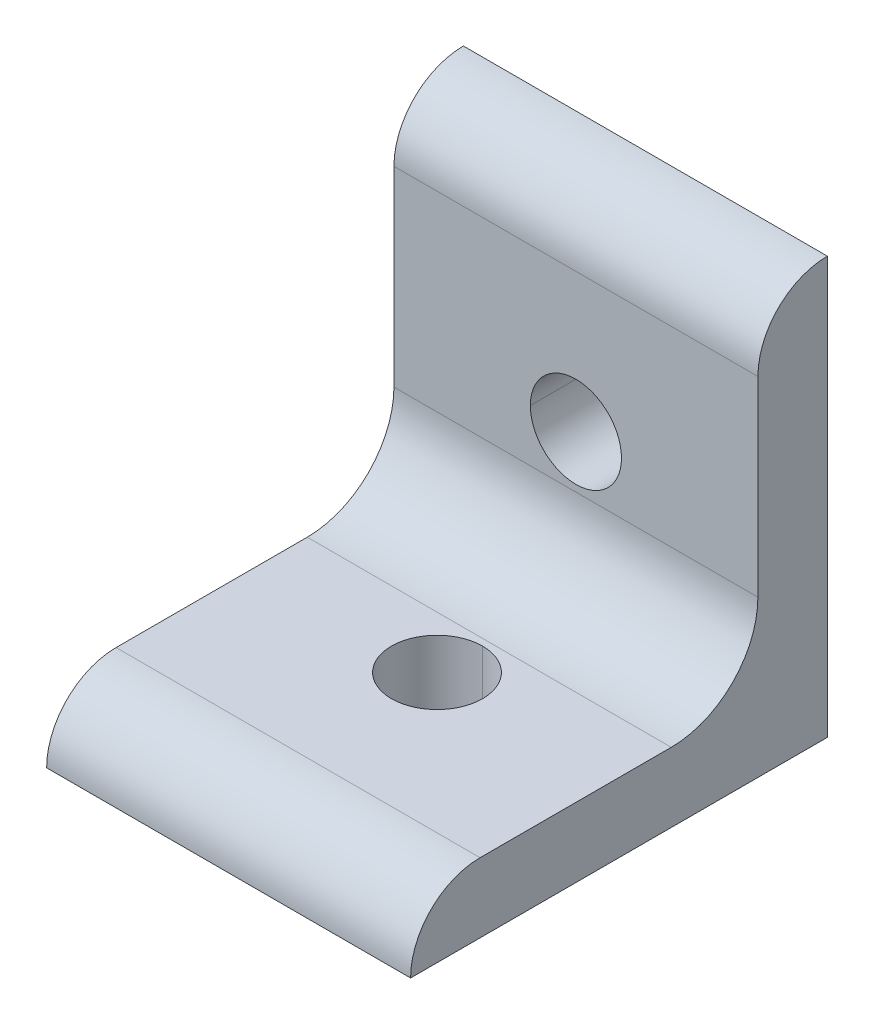
ISO-10303-21;
HEADER;
FILE_DESCRIPTION(('STEP AP214'),'2;1');
FILE_NAME('part.step','',(''),(''),'','','');
FILE_SCHEMA(('AUTOMOTIVE_DESIGN { 1 0 10303 214 1 1 1 1 }'));
ENDSEC;
DATA;
#1=APPLICATION_CONTEXT('core data for automotive mechanical design processes');
#2=APPLICATION_PROTOCOL_DEFINITION('international standard','automotive_design',2000,#1);
#3=PRODUCT_CONTEXT('',#1,'mechanical');
#4=PRODUCT('Part','Part','',(#3));
#5=PRODUCT_RELATED_PRODUCT_CATEGORY('part','',(#4));
#6=PRODUCT_DEFINITION_FORMATION('','',#4);
#7=PRODUCT_DEFINITION_CONTEXT('part definition',#1,'design');
#8=PRODUCT_DEFINITION('design','',#6,#7);
#9=PRODUCT_DEFINITION_SHAPE('','',#8);
#10=(LENGTH_UNIT() NAMED_UNIT(*) SI_UNIT(.MILLI.,.METRE.));
#11=(NAMED_UNIT(*) PLANE_ANGLE_UNIT() SI_UNIT($,.RADIAN.));
#12=(NAMED_UNIT(*) SI_UNIT($,.STERADIAN.) SOLID_ANGLE_UNIT());
#13=UNCERTAINTY_MEASURE_WITH_UNIT(LENGTH_MEASURE(1.E-05),#10,'distance_accuracy_value','');
#14=(GEOMETRIC_REPRESENTATION_CONTEXT(3) GLOBAL_UNCERTAINTY_ASSIGNED_CONTEXT((#13)) GLOBAL_UNIT_ASSIGNED_CONTEXT((#10,
#11,#12)) REPRESENTATION_CONTEXT('',''));
#15=CARTESIAN_POINT('',(0.,0.,0.));
#16=DIRECTION('',(0.,0.,1.));
#17=DIRECTION('',(1.,0.,0.));
#18=AXIS2_PLACEMENT_3D('',#15,#16,#17);
#19=CARTESIAN_POINT('',(7.20261909646393,12.5858555645789,28.1777497000586));
#20=DIRECTION('',(-1.,0.,0.));
#21=DIRECTION('',(0.,-0.707106781186548,-0.707106781186547));
#22=AXIS2_PLACEMENT_3D('',#19,#20,#21);
#23=CYLINDRICAL_SURFACE('',#22,6.35000000000146);
#24=CARTESIAN_POINT('',(-26.0713809035361,12.5858555645789,28.1777497000586));
#25=DIRECTION('',(1.,0.,0.));
#26=DIRECTION('',(0.,0.,-1.));
#27=AXIS2_PLACEMENT_3D('',#24,#25,#26);
#28=CIRCLE('',#27,6.35000000000146);
#29=CARTESIAN_POINT('',(-26.0713809035361,18.9358555645804,28.17774970006));
#30=VERTEX_POINT('',#29);
#31=CARTESIAN_POINT('',(-26.0713809035361,12.5858555645804,34.52774970006));
#32=VERTEX_POINT('',#31);
#33=EDGE_CURVE('E11',#30,#32,#28,.T.);
#34=ORIENTED_EDGE('',*,*,#33,.T.);
#35=DIRECTION('',(-1.,0.,0.));
#36=VECTOR('',#35,1.);
#37=CARTESIAN_POINT('',(7.20261909646393,12.5858555645804,34.52774970006));
#38=LINE('',#37,#36);
#39=CARTESIAN_POINT('',(7.20261909646393,12.5858555645804,34.52774970006));
#40=VERTEX_POINT('',#39);
#41=EDGE_CURVE('E56',#40,#32,#38,.T.);
#42=ORIENTED_EDGE('',*,*,#41,.F.);
#43=CARTESIAN_POINT('',(7.20261909646393,12.5858555645789,28.1777497000586));
#44=DIRECTION('',(1.,0.,0.));
#45=DIRECTION('',(0.,0.,-1.));
#46=AXIS2_PLACEMENT_3D('',#43,#44,#45);
#47=CIRCLE('',#46,6.35000000000146);
#48=CARTESIAN_POINT('',(7.20261909646393,18.9358555645804,28.17774970006));
#49=VERTEX_POINT('',#48);
#50=EDGE_CURVE('E317',#49,#40,#47,.T.);
#51=ORIENTED_EDGE('',*,*,#50,.F.);
#52=DIRECTION('',(-1.,0.,0.));
#53=VECTOR('',#52,1.);
#54=CARTESIAN_POINT('',(7.20261909646393,18.9358555645804,28.17774970006));
#55=LINE('',#54,#53);
#56=EDGE_CURVE('E312',#49,#30,#55,.T.);
#57=ORIENTED_EDGE('',*,*,#56,.T.);
#58=EDGE_LOOP('',(#34,#42,#51,#57));
#59=FACE_BOUND('',#58,.T.);
#60=ADVANCED_FACE('F47',(#59),#23,.T.);
#61=CARTESIAN_POINT('',(7.20261909646393,18.9358555645804,10.70254970006));
#62=DIRECTION('',(0.,-1.,0.));
#63=DIRECTION('',(0.,0.,-1.));
#64=AXIS2_PLACEMENT_3D('',#61,#62,#63);
#65=PLANE('',#64);
#66=CARTESIAN_POINT('',(-9.43438090353607,18.9358555645804,15.47774970006));
#67=DIRECTION('',(0.,1.,0.));
#68=DIRECTION('',(1.,0.,0.));
#69=AXIS2_PLACEMENT_3D('',#66,#67,#68);
#70=CIRCLE('',#69,4.1656);
#71=CARTESIAN_POINT('',(-9.43438090353607,18.9358555645804,11.31214970006));
#72=VERTEX_POINT('',#71);
#73=CARTESIAN_POINT('',(-9.43438090353607,18.9358555645804,19.64334970006));
#74=VERTEX_POINT('',#73);
#75=EDGE_CURVE('E307',#72,#74,#70,.T.);
#76=ORIENTED_EDGE('',*,*,#75,.F.);
#77=CARTESIAN_POINT('',(-9.43438090353607,18.9358555645804,15.47774970006));
#78=DIRECTION('',(0.,1.,0.));
#79=DIRECTION('',(0.,0.,1.));
#80=AXIS2_PLACEMENT_3D('',#77,#78,#79);
#81=CIRCLE('',#80,4.1656);
#82=EDGE_CURVE('E170',#74,#72,#81,.T.);
#83=ORIENTED_EDGE('',*,*,#82,.F.);
#84=EDGE_LOOP('',(#76,#83));
#85=FACE_BOUND('',#84,.T.);
#86=DIRECTION('',(0.,0.,1.));
#87=VECTOR('',#86,1.);
#88=CARTESIAN_POINT('',(-26.0713809035361,18.9358555645804,10.70254970006));
#89=LINE('',#88,#87);
#90=CARTESIAN_POINT('',(-26.0713809035361,18.9358555645804,10.70254970006));
#91=VERTEX_POINT('',#90);
#92=EDGE_CURVE('E297',#91,#30,#89,.T.);
#93=ORIENTED_EDGE('',*,*,#92,.T.);
#94=ORIENTED_EDGE('',*,*,#56,.F.);
#95=DIRECTION('',(0.,0.,1.));
#96=VECTOR('',#95,1.);
#97=CARTESIAN_POINT('',(7.20261909646393,18.9358555645804,10.70254970006));
#98=LINE('',#97,#96);
#99=CARTESIAN_POINT('',(7.20261909646393,18.9358555645804,10.70254970006));
#100=VERTEX_POINT('',#99);
#101=EDGE_CURVE('E291',#100,#49,#98,.T.);
#102=ORIENTED_EDGE('',*,*,#101,.F.);
#103=DIRECTION('',(-1.,0.,0.));
#104=VECTOR('',#103,1.);
#105=CARTESIAN_POINT('',(7.20261909646393,18.9358555645804,10.70254970006));
#106=LINE('',#105,#104);
#107=EDGE_CURVE('E287',#100,#91,#106,.T.);
#108=ORIENTED_EDGE('',*,*,#107,.T.);
#109=EDGE_LOOP('',(#93,#94,#102,#108));
#110=FACE_BOUND('',#109,.T.);
#111=ADVANCED_FACE('F336',(#85,#110),#65,.F.);
#112=CARTESIAN_POINT('',(7.20261909646393,26.8606555645806,10.7025497000603));
#113=DIRECTION('',(-1.,0.,0.));
#114=DIRECTION('',(0.,0.707106781186537,0.707106781186558));
#115=AXIS2_PLACEMENT_3D('',#112,#113,#114);
#116=CYLINDRICAL_SURFACE('',#115,7.92480000000024);
#117=CARTESIAN_POINT('',(-26.0713809035361,26.8606555645806,10.7025497000603));
#118=DIRECTION('',(1.,0.,0.));
#119=DIRECTION('',(0.,0.,-1.));
#120=AXIS2_PLACEMENT_3D('',#117,#118,#119);
#121=CIRCLE('',#120,7.92480000000024);
#122=CARTESIAN_POINT('',(-26.0713809035361,26.8606555645804,2.77774970006001));
#123=VERTEX_POINT('',#122);
#124=EDGE_CURVE('E281',#91,#123,#121,.T.);
#125=ORIENTED_EDGE('',*,*,#124,.F.);
#126=ORIENTED_EDGE('',*,*,#107,.F.);
#127=CARTESIAN_POINT('',(7.20261909646393,26.8606555645806,10.7025497000603));
#128=DIRECTION('',(1.,0.,0.));
#129=DIRECTION('',(0.,0.,-1.));
#130=AXIS2_PLACEMENT_3D('',#127,#128,#129);
#131=CIRCLE('',#130,7.92480000000024);
#132=CARTESIAN_POINT('',(7.20261909646393,26.8606555645804,2.77774970006001));
#133=VERTEX_POINT('',#132);
#134=EDGE_CURVE('E276',#100,#133,#131,.T.);
#135=ORIENTED_EDGE('',*,*,#134,.T.);
#136=DIRECTION('',(-1.,0.,0.));
#137=VECTOR('',#136,1.);
#138=CARTESIAN_POINT('',(7.20261909646393,26.8606555645804,2.77774970006001));
#139=LINE('',#138,#137);
#140=EDGE_CURVE('E271',#133,#123,#139,.T.);
#141=ORIENTED_EDGE('',*,*,#140,.T.);
#142=EDGE_LOOP('',(#125,#126,#135,#141));
#143=FACE_BOUND('',#142,.T.);
#144=ADVANCED_FACE('F353',(#143),#116,.F.);
#145=CARTESIAN_POINT('',(7.20261909646393,44.3358555645804,2.77774970006001));
#146=DIRECTION('',(0.,0.,-1.));
#147=DIRECTION('',(-1.,0.,0.));
#148=AXIS2_PLACEMENT_3D('',#145,#146,#147);
#149=PLANE('',#148);
#150=CARTESIAN_POINT('',(-9.43438090353607,31.6358555645804,2.77774970006001));
#151=DIRECTION('',(0.,0.,1.));
#152=DIRECTION('',(1.,0.,0.));
#153=AXIS2_PLACEMENT_3D('',#150,#151,#152);
#154=CIRCLE('',#153,4.1656);
#155=CARTESIAN_POINT('',(-13.5999809035361,31.6358555645804,2.77774970006001));
#156=VERTEX_POINT('',#155);
#157=CARTESIAN_POINT('',(-5.26878090353607,31.6358555645804,2.77774970006001));
#158=VERTEX_POINT('',#157);
#159=EDGE_CURVE('E265',#156,#158,#154,.T.);
#160=ORIENTED_EDGE('',*,*,#159,.F.);
#161=CARTESIAN_POINT('',(-9.43438090353607,31.6358555645804,2.77774970006001));
#162=DIRECTION('',(0.,0.,1.));
#163=DIRECTION('',(1.,0.,0.));
#164=AXIS2_PLACEMENT_3D('',#161,#162,#163);
#165=CIRCLE('',#164,4.1656);
#166=EDGE_CURVE('E259',#158,#156,#165,.T.);
#167=ORIENTED_EDGE('',*,*,#166,.F.);
#168=EDGE_LOOP('',(#160,#167));
#169=FACE_BOUND('',#168,.T.);
#170=DIRECTION('',(0.,-1.,0.));
#171=VECTOR('',#170,1.);
#172=CARTESIAN_POINT('',(-26.0713809035361,44.3358555645804,2.77774970006001));
#173=LINE('',#172,#171);
#174=CARTESIAN_POINT('',(-26.0713809035361,44.3358555645804,2.77774970006001));
#175=VERTEX_POINT('',#174);
#176=EDGE_CURVE('E253',#175,#123,#173,.T.);
#177=ORIENTED_EDGE('',*,*,#176,.T.);
#178=ORIENTED_EDGE('',*,*,#140,.F.);
#179=DIRECTION('',(0.,-1.,0.));
#180=VECTOR('',#179,1.);
#181=CARTESIAN_POINT('',(7.20261909646393,44.3358555645804,2.77774970006001));
#182=LINE('',#181,#180);
#183=CARTESIAN_POINT('',(7.20261909646393,44.3358555645804,2.77774970006001));
#184=VERTEX_POINT('',#183);
#185=EDGE_CURVE('E247',#184,#133,#182,.T.);
#186=ORIENTED_EDGE('',*,*,#185,.F.);
#187=DIRECTION('',(-1.,0.,0.));
#188=VECTOR('',#187,1.);
#189=CARTESIAN_POINT('',(7.20261909646393,44.3358555645804,2.77774970006001));
#190=LINE('',#189,#188);
#191=EDGE_CURVE('E242',#184,#175,#190,.T.);
#192=ORIENTED_EDGE('',*,*,#191,.T.);
#193=EDGE_LOOP('',(#177,#178,#186,#192));
#194=FACE_BOUND('',#193,.T.);
#195=ADVANCED_FACE('F351',(#169,#194),#149,.F.);
#196=CARTESIAN_POINT('',(7.20261909646393,44.3358555645789,-3.57225029994145));
#197=DIRECTION('',(-1.,0.,0.));
#198=DIRECTION('',(0.,-0.707106781186547,-0.707106781186548));
#199=AXIS2_PLACEMENT_3D('',#196,#197,#198);
#200=CYLINDRICAL_SURFACE('',#199,6.35000000000146);
#201=CARTESIAN_POINT('',(-26.0713809035361,44.3358555645789,-3.57225029994145));
#202=DIRECTION('',(1.,0.,0.));
#203=DIRECTION('',(0.,0.,-1.));
#204=AXIS2_PLACEMENT_3D('',#201,#202,#203);
#205=CIRCLE('',#204,6.35000000000146);
#206=CARTESIAN_POINT('',(-26.0713809035361,50.6858555645804,-3.57225029993999));
#207=VERTEX_POINT('',#206);
#208=EDGE_CURVE('E236',#207,#175,#205,.T.);
#209=ORIENTED_EDGE('',*,*,#208,.T.);
#210=ORIENTED_EDGE('',*,*,#191,.F.);
#211=CARTESIAN_POINT('',(7.20261909646393,44.3358555645789,-3.57225029994145));
#212=DIRECTION('',(1.,0.,0.));
#213=DIRECTION('',(0.,0.,-1.));
#214=AXIS2_PLACEMENT_3D('',#211,#212,#213);
#215=CIRCLE('',#214,6.35000000000146);
#216=CARTESIAN_POINT('',(7.20261909646393,50.6858555645804,-3.57225029993999));
#217=VERTEX_POINT('',#216);
#218=EDGE_CURVE('E230',#217,#184,#215,.T.);
#219=ORIENTED_EDGE('',*,*,#218,.F.);
#220=DIRECTION('',(-1.,0.,0.));
#221=VECTOR('',#220,1.);
#222=CARTESIAN_POINT('',(7.20261909646393,50.6858555645804,-3.57225029993999));
#223=LINE('',#222,#221);
#224=EDGE_CURVE('E226',#217,#207,#223,.T.);
#225=ORIENTED_EDGE('',*,*,#224,.T.);
#226=EDGE_LOOP('',(#209,#210,#219,#225));
#227=FACE_BOUND('',#226,.T.);
#228=ADVANCED_FACE('F349',(#227),#200,.T.);
#229=CARTESIAN_POINT('',(7.20261909646393,12.5858555645804,-3.57225029993999));
#230=DIRECTION('',(0.,0.,1.));
#231=DIRECTION('',(1.,0.,0.));
#232=AXIS2_PLACEMENT_3D('',#229,#230,#231);
#233=PLANE('',#232);
#234=CARTESIAN_POINT('',(-9.43438090353607,31.6358555645804,-3.57225029993999));
#235=DIRECTION('',(0.,0.,1.));
#236=DIRECTION('',(1.,0.,0.));
#237=AXIS2_PLACEMENT_3D('',#234,#235,#236);
#238=CIRCLE('',#237,4.1656);
#239=CARTESIAN_POINT('',(-5.26878090353607,31.6358555645804,-3.57225029993999));
#240=VERTEX_POINT('',#239);
#241=CARTESIAN_POINT('',(-13.5999809035361,31.6358555645804,-3.57225029993999));
#242=VERTEX_POINT('',#241);
#243=EDGE_CURVE('E221',#240,#242,#238,.T.);
#244=ORIENTED_EDGE('',*,*,#243,.T.);
#245=CARTESIAN_POINT('',(-9.43438090353607,31.6358555645804,-3.57225029993999));
#246=DIRECTION('',(0.,0.,1.));
#247=DIRECTION('',(1.,0.,0.));
#248=AXIS2_PLACEMENT_3D('',#245,#246,#247);
#249=CIRCLE('',#248,4.1656);
#250=EDGE_CURVE('E216',#242,#240,#249,.T.);
#251=ORIENTED_EDGE('',*,*,#250,.T.);
#252=EDGE_LOOP('',(#244,#251));
#253=FACE_BOUND('',#252,.T.);
#254=DIRECTION('',(0.,1.,0.));
#255=VECTOR('',#254,1.);
#256=CARTESIAN_POINT('',(-26.0713809035361,12.5858555645804,-3.57225029993999));
#257=LINE('',#256,#255);
#258=CARTESIAN_POINT('',(-26.0713809035361,12.5858555645804,-3.57225029993999));
#259=VERTEX_POINT('',#258);
#260=EDGE_CURVE('E211',#259,#207,#257,.T.);
#261=ORIENTED_EDGE('',*,*,#260,.T.);
#262=ORIENTED_EDGE('',*,*,#224,.F.);
#263=DIRECTION('',(0.,1.,0.));
#264=VECTOR('',#263,1.);
#265=CARTESIAN_POINT('',(7.20261909646393,12.5858555645804,-3.57225029993999));
#266=LINE('',#265,#264);
#267=CARTESIAN_POINT('',(7.20261909646393,12.5858555645804,-3.57225029993999));
#268=VERTEX_POINT('',#267);
#269=EDGE_CURVE('E205',#268,#217,#266,.T.);
#270=ORIENTED_EDGE('',*,*,#269,.F.);
#271=DIRECTION('',(-1.,0.,0.));
#272=VECTOR('',#271,1.);
#273=CARTESIAN_POINT('',(7.20261909646393,12.5858555645804,-3.57225029993999));
#274=LINE('',#273,#272);
#275=EDGE_CURVE('E167',#268,#259,#274,.T.);
#276=ORIENTED_EDGE('',*,*,#275,.T.);
#277=EDGE_LOOP('',(#261,#262,#270,#276));
#278=FACE_BOUND('',#277,.T.);
#279=ADVANCED_FACE('F345',(#253,#278),#233,.F.);
#280=CARTESIAN_POINT('',(7.20261909646393,12.5858555645804,34.52774970006));
#281=DIRECTION('',(0.,1.,0.));
#282=DIRECTION('',(0.,0.,1.));
#283=AXIS2_PLACEMENT_3D('',#280,#281,#282);
#284=PLANE('',#283);
#285=CARTESIAN_POINT('',(-9.43438090353607,12.5858555645804,15.47774970006));
#286=DIRECTION('',(0.,1.,0.));
#287=DIRECTION('',(1.,0.,0.));
#288=AXIS2_PLACEMENT_3D('',#285,#286,#287);
#289=CIRCLE('',#288,4.1656);
#290=CARTESIAN_POINT('',(-9.43438090353607,12.5858555645804,11.31214970006));
#291=VERTEX_POINT('',#290);
#292=CARTESIAN_POINT('',(-9.43438090353607,12.5858555645804,19.64334970006));
#293=VERTEX_POINT('',#292);
#294=EDGE_CURVE('E151',#291,#293,#289,.T.);
#295=ORIENTED_EDGE('',*,*,#294,.T.);
#296=CARTESIAN_POINT('',(-9.43438090353607,12.5858555645804,15.47774970006));
#297=DIRECTION('',(0.,1.,0.));
#298=DIRECTION('',(0.,0.,1.));
#299=AXIS2_PLACEMENT_3D('',#296,#297,#298);
#300=CIRCLE('',#299,4.1656);
#301=EDGE_CURVE('E147',#293,#291,#300,.T.);
#302=ORIENTED_EDGE('',*,*,#301,.T.);
#303=EDGE_LOOP('',(#295,#302));
#304=FACE_BOUND('',#303,.T.);
#305=DIRECTION('',(0.,0.,-1.));
#306=VECTOR('',#305,1.);
#307=CARTESIAN_POINT('',(-26.0713809035361,12.5858555645804,34.52774970006));
#308=LINE('',#307,#306);
#309=EDGE_CURVE('E157',#32,#259,#308,.T.);
#310=ORIENTED_EDGE('',*,*,#309,.T.);
#311=ORIENTED_EDGE('',*,*,#275,.F.);
#312=DIRECTION('',(0.,0.,-1.));
#313=VECTOR('',#312,1.);
#314=CARTESIAN_POINT('',(7.20261909646393,12.5858555645804,34.52774970006));
#315=LINE('',#314,#313);
#316=EDGE_CURVE('E177',#40,#268,#315,.T.);
#317=ORIENTED_EDGE('',*,*,#316,.F.);
#318=ORIENTED_EDGE('',*,*,#41,.T.);
#319=EDGE_LOOP('',(#310,#311,#317,#318));
#320=FACE_BOUND('',#319,.T.);
#321=ADVANCED_FACE('F149',(#304,#320),#284,.F.);
#322=CARTESIAN_POINT('',(7.20261909646393,12.5858555645789,28.1777497000586));
#323=DIRECTION('',(1.,0.,0.));
#324=DIRECTION('',(0.,0.,-1.));
#325=AXIS2_PLACEMENT_3D('',#322,#323,#324);
#326=PLANE('',#325);
#327=ORIENTED_EDGE('',*,*,#50,.T.);
#328=ORIENTED_EDGE('',*,*,#316,.T.);
#329=ORIENTED_EDGE('',*,*,#269,.T.);
#330=ORIENTED_EDGE('',*,*,#218,.T.);
#331=ORIENTED_EDGE('',*,*,#185,.T.);
#332=ORIENTED_EDGE('',*,*,#134,.F.);
#333=ORIENTED_EDGE('',*,*,#101,.T.);
#334=EDGE_LOOP('',(#327,#328,#329,#330,#331,#332,#333));
#335=FACE_BOUND('',#334,.T.);
#336=ADVANCED_FACE('F331',(#335),#326,.T.);
#337=CARTESIAN_POINT('',(-26.0713809035361,12.5858555645789,28.1777497000586));
#338=DIRECTION('',(1.,0.,0.));
#339=DIRECTION('',(0.,0.,-1.));
#340=AXIS2_PLACEMENT_3D('',#337,#338,#339);
#341=PLANE('',#340);
#342=ORIENTED_EDGE('',*,*,#33,.F.);
#343=ORIENTED_EDGE('',*,*,#92,.F.);
#344=ORIENTED_EDGE('',*,*,#124,.T.);
#345=ORIENTED_EDGE('',*,*,#176,.F.);
#346=ORIENTED_EDGE('',*,*,#208,.F.);
#347=ORIENTED_EDGE('',*,*,#260,.F.);
#348=ORIENTED_EDGE('',*,*,#309,.F.);
#349=EDGE_LOOP('',(#342,#343,#344,#345,#346,#347,#348));
#350=FACE_BOUND('',#349,.T.);
#351=ADVANCED_FACE('F340',(#350),#341,.F.);
#352=CARTESIAN_POINT('',(-9.43438090353607,18.9358555645804,15.47774970006));
#353=DIRECTION('',(0.,-1.,0.));
#354=DIRECTION('',(-1.,0.,0.));
#355=AXIS2_PLACEMENT_3D('',#352,#353,#354);
#356=CYLINDRICAL_SURFACE('',#355,4.1656);
#357=DIRECTION('',(0.,-1.,0.));
#358=VECTOR('',#357,1.);
#359=CARTESIAN_POINT('',(-9.43438090353607,18.9358555645804,19.64334970006));
#360=LINE('',#359,#358);
#361=EDGE_CURVE('E165',#74,#293,#360,.T.);
#362=ORIENTED_EDGE('',*,*,#361,.F.);
#363=ORIENTED_EDGE('',*,*,#82,.T.);
#364=DIRECTION('',(0.,-1.,0.));
#365=VECTOR('',#364,1.);
#366=CARTESIAN_POINT('',(-9.43438090353607,18.9358555645804,11.31214970006));
#367=LINE('',#366,#365);
#368=EDGE_CURVE('E163',#72,#291,#367,.T.);
#369=ORIENTED_EDGE('',*,*,#368,.T.);
#370=ORIENTED_EDGE('',*,*,#301,.F.);
#371=EDGE_LOOP('',(#362,#363,#369,#370));
#372=FACE_BOUND('',#371,.T.);
#373=ADVANCED_FACE('F169',(#372),#356,.F.);
#374=CARTESIAN_POINT('',(-9.43438090353607,18.9358555645804,15.47774970006));
#375=DIRECTION('',(0.,-1.,0.));
#376=DIRECTION('',(1.,0.,0.));
#377=AXIS2_PLACEMENT_3D('',#374,#375,#376);
#378=CYLINDRICAL_SURFACE('',#377,4.1656);
#379=ORIENTED_EDGE('',*,*,#361,.T.);
#380=ORIENTED_EDGE('',*,*,#294,.F.);
#381=ORIENTED_EDGE('',*,*,#368,.F.);
#382=ORIENTED_EDGE('',*,*,#75,.T.);
#383=EDGE_LOOP('',(#379,#380,#381,#382));
#384=FACE_BOUND('',#383,.T.);
#385=ADVANCED_FACE('F161',(#384),#378,.F.);
#386=CARTESIAN_POINT('',(-9.43438090353607,31.6358555645804,2.77774970006001));
#387=DIRECTION('',(0.,0.,-1.));
#388=DIRECTION('',(0.,1.,0.));
#389=AXIS2_PLACEMENT_3D('',#386,#387,#388);
#390=CYLINDRICAL_SURFACE('',#389,4.1656);
#391=DIRECTION('',(0.,0.,-1.));
#392=VECTOR('',#391,1.);
#393=CARTESIAN_POINT('',(-5.26878090353607,31.6358555645804,2.77774970006001));
#394=LINE('',#393,#392);
#395=EDGE_CURVE('E172',#158,#240,#394,.T.);
#396=ORIENTED_EDGE('',*,*,#395,.T.);
#397=ORIENTED_EDGE('',*,*,#250,.F.);
#398=DIRECTION('',(0.,0.,-1.));
#399=VECTOR('',#398,1.);
#400=CARTESIAN_POINT('',(-13.5999809035361,31.6358555645804,2.77774970006001));
#401=LINE('',#400,#399);
#402=EDGE_CURVE('E181',#156,#242,#401,.T.);
#403=ORIENTED_EDGE('',*,*,#402,.F.);
#404=ORIENTED_EDGE('',*,*,#159,.T.);
#405=EDGE_LOOP('',(#396,#397,#403,#404));
#406=FACE_BOUND('',#405,.T.);
#407=ADVANCED_FACE('F408',(#406),#390,.F.);
#408=CARTESIAN_POINT('',(-9.43438090353607,31.6358555645804,2.77774970006001));
#409=DIRECTION('',(0.,0.,-1.));
#410=DIRECTION('',(0.,-1.,0.));
#411=AXIS2_PLACEMENT_3D('',#408,#409,#410);
#412=CYLINDRICAL_SURFACE('',#411,4.1656);
#413=ORIENTED_EDGE('',*,*,#395,.F.);
#414=ORIENTED_EDGE('',*,*,#166,.T.);
#415=ORIENTED_EDGE('',*,*,#402,.T.);
#416=ORIENTED_EDGE('',*,*,#243,.F.);
#417=EDGE_LOOP('',(#413,#414,#415,#416));
#418=FACE_BOUND('',#417,.T.);
#419=ADVANCED_FACE('F415',(#418),#412,.F.);
#420=CLOSED_SHELL('',(#60,#111,#144,#195,#228,#279,#321,#336,#351,#373,#385,#407,#419));
#421=MANIFOLD_SOLID_BREP('B2',#420);
#422=ADVANCED_BREP_SHAPE_REPRESENTATION('',(#18,#421),#14);
#423=SHAPE_DEFINITION_REPRESENTATION(#9,#422);
ENDSEC;
END-ISO-10303-21;
